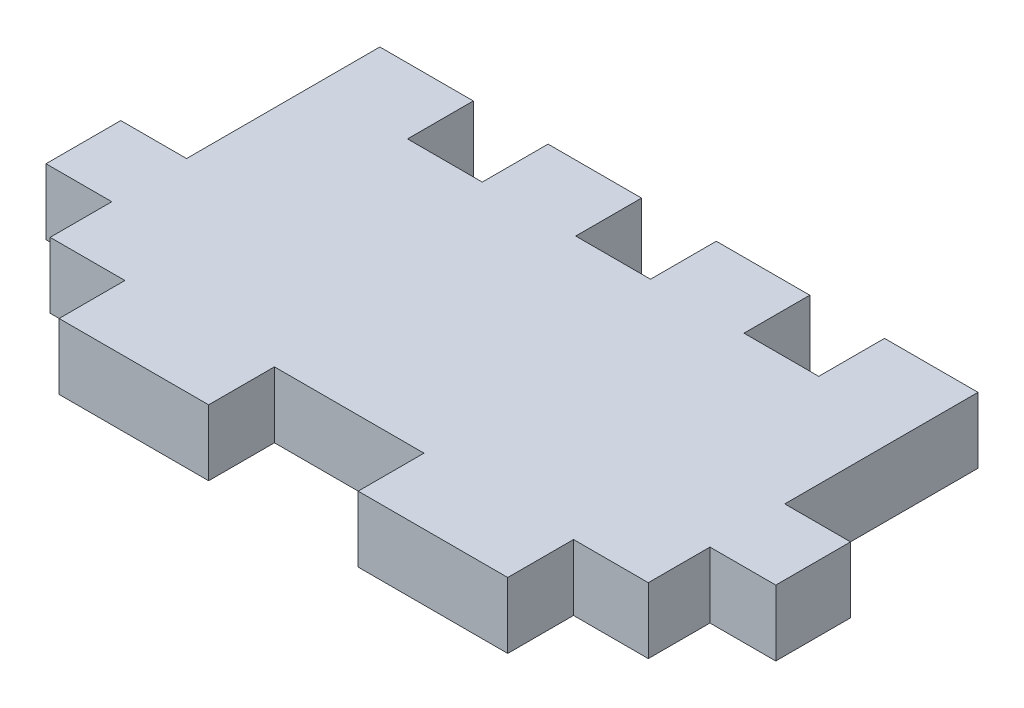
ISO-10303-21;
HEADER;
FILE_DESCRIPTION(('STEP AP214'),'2;1');
FILE_NAME('part.step','',(''),(''),'','','');
FILE_SCHEMA(('AUTOMOTIVE_DESIGN { 1 0 10303 214 1 1 1 1 }'));
ENDSEC;
DATA;
#1=APPLICATION_CONTEXT('core data for automotive mechanical design processes');
#2=APPLICATION_PROTOCOL_DEFINITION('international standard','automotive_design',2000,#1);
#3=PRODUCT_CONTEXT('',#1,'mechanical');
#4=PRODUCT('Part','Part','',(#3));
#5=PRODUCT_RELATED_PRODUCT_CATEGORY('part','',(#4));
#6=PRODUCT_DEFINITION_FORMATION('','',#4);
#7=PRODUCT_DEFINITION_CONTEXT('part definition',#1,'design');
#8=PRODUCT_DEFINITION('design','',#6,#7);
#9=PRODUCT_DEFINITION_SHAPE('','',#8);
#10=(LENGTH_UNIT() NAMED_UNIT(*) SI_UNIT(.MILLI.,.METRE.));
#11=(NAMED_UNIT(*) PLANE_ANGLE_UNIT() SI_UNIT($,.RADIAN.));
#12=(NAMED_UNIT(*) SI_UNIT($,.STERADIAN.) SOLID_ANGLE_UNIT());
#13=UNCERTAINTY_MEASURE_WITH_UNIT(LENGTH_MEASURE(1.E-05),#10,'distance_accuracy_value','');
#14=(GEOMETRIC_REPRESENTATION_CONTEXT(3) GLOBAL_UNCERTAINTY_ASSIGNED_CONTEXT((#13)) GLOBAL_UNIT_ASSIGNED_CONTEXT((#10,
#11,#12)) REPRESENTATION_CONTEXT('',''));
#15=CARTESIAN_POINT('',(0.,0.,0.));
#16=DIRECTION('',(0.,0.,1.));
#17=DIRECTION('',(1.,0.,0.));
#18=AXIS2_PLACEMENT_3D('',#15,#16,#17);
#19=CARTESIAN_POINT('',(0.,5.588,11.2059974));
#20=DIRECTION('',(0.,0.,1.));
#21=DIRECTION('',(1.,0.,0.));
#22=AXIS2_PLACEMENT_3D('',#19,#20,#21);
#23=PLANE('',#22);
#24=DIRECTION('',(-1.,0.,0.));
#25=VECTOR('',#24,1.);
#26=CARTESIAN_POINT('',(0.,0.,11.2059974));
#27=LINE('',#26,#25);
#28=CARTESIAN_POINT('',(25.4,0.,11.2059974));
#29=VERTEX_POINT('',#28);
#30=CARTESIAN_POINT('',(19.05,0.,11.2059974));
#31=VERTEX_POINT('',#30);
#32=EDGE_CURVE('E277',#29,#31,#27,.T.);
#33=ORIENTED_EDGE('',*,*,#32,.F.);
#34=DIRECTION('',(0.,-1.,0.));
#35=VECTOR('',#34,1.);
#36=CARTESIAN_POINT('',(25.4,5.588,11.2059974));
#37=LINE('',#36,#35);
#38=CARTESIAN_POINT('',(25.4,5.588,11.2059974));
#39=VERTEX_POINT('',#38);
#40=EDGE_CURVE('E11',#39,#29,#37,.T.);
#41=ORIENTED_EDGE('',*,*,#40,.F.);
#42=DIRECTION('',(-1.,0.,0.));
#43=VECTOR('',#42,1.);
#44=CARTESIAN_POINT('',(0.,5.588,11.2059974));
#45=LINE('',#44,#43);
#46=CARTESIAN_POINT('',(19.05,5.588,11.2059974));
#47=VERTEX_POINT('',#46);
#48=EDGE_CURVE('E355',#39,#47,#45,.T.);
#49=ORIENTED_EDGE('',*,*,#48,.T.);
#50=DIRECTION('',(0.,-1.,0.));
#51=VECTOR('',#50,1.);
#52=CARTESIAN_POINT('',(19.05,5.588,11.2059974));
#53=LINE('',#52,#51);
#54=EDGE_CURVE('E53',#47,#31,#53,.T.);
#55=ORIENTED_EDGE('',*,*,#54,.T.);
#56=EDGE_LOOP('',(#33,#41,#49,#55));
#57=FACE_BOUND('',#56,.T.);
#58=ADVANCED_FACE('F37',(#57),#23,.T.);
#59=CARTESIAN_POINT('',(25.4,5.588,0.));
#60=DIRECTION('',(-1.,0.,0.));
#61=DIRECTION('',(0.,0.,1.));
#62=AXIS2_PLACEMENT_3D('',#59,#60,#61);
#63=PLANE('',#62);
#64=DIRECTION('',(0.,0.,-1.));
#65=VECTOR('',#64,1.);
#66=CARTESIAN_POINT('',(25.4,0.,0.));
#67=LINE('',#66,#65);
#68=CARTESIAN_POINT('',(25.4,0.,5.9689974));
#69=VERTEX_POINT('',#68);
#70=EDGE_CURVE('E279',#29,#69,#67,.T.);
#71=ORIENTED_EDGE('',*,*,#70,.T.);
#72=DIRECTION('',(0.,-1.,0.));
#73=VECTOR('',#72,1.);
#74=CARTESIAN_POINT('',(25.4,5.588,5.9689974));
#75=LINE('',#74,#73);
#76=CARTESIAN_POINT('',(25.4,5.588,5.9689974));
#77=VERTEX_POINT('',#76);
#78=EDGE_CURVE('E45',#77,#69,#75,.T.);
#79=ORIENTED_EDGE('',*,*,#78,.F.);
#80=DIRECTION('',(0.,0.,-1.));
#81=VECTOR('',#80,1.);
#82=CARTESIAN_POINT('',(25.4,5.588,0.));
#83=LINE('',#82,#81);
#84=EDGE_CURVE('E438',#39,#77,#83,.T.);
#85=ORIENTED_EDGE('',*,*,#84,.F.);
#86=ORIENTED_EDGE('',*,*,#40,.T.);
#87=EDGE_LOOP('',(#71,#79,#85,#86));
#88=FACE_BOUND('',#87,.T.);
#89=ADVANCED_FACE('F426',(#88),#63,.F.);
#90=CARTESIAN_POINT('',(0.,5.588,5.9689974));
#91=DIRECTION('',(0.,0.,1.));
#92=DIRECTION('',(1.,0.,0.));
#93=AXIS2_PLACEMENT_3D('',#90,#91,#92);
#94=PLANE('',#93);
#95=DIRECTION('',(-1.,0.,0.));
#96=VECTOR('',#95,1.);
#97=CARTESIAN_POINT('',(0.,0.,5.9689974));
#98=LINE('',#97,#96);
#99=CARTESIAN_POINT('',(30.988,0.,5.9689974));
#100=VERTEX_POINT('',#99);
#101=EDGE_CURVE('E282',#100,#69,#98,.T.);
#102=ORIENTED_EDGE('',*,*,#101,.F.);
#103=DIRECTION('',(0.,-1.,0.));
#104=VECTOR('',#103,1.);
#105=CARTESIAN_POINT('',(30.988,5.588,5.9689974));
#106=LINE('',#105,#104);
#107=CARTESIAN_POINT('',(30.988,5.588,5.9689974));
#108=VERTEX_POINT('',#107);
#109=EDGE_CURVE('E416',#108,#100,#106,.T.);
#110=ORIENTED_EDGE('',*,*,#109,.F.);
#111=DIRECTION('',(-1.,0.,0.));
#112=VECTOR('',#111,1.);
#113=CARTESIAN_POINT('',(0.,5.588,5.9689974));
#114=LINE('',#113,#112);
#115=EDGE_CURVE('E423',#108,#77,#114,.T.);
#116=ORIENTED_EDGE('',*,*,#115,.T.);
#117=ORIENTED_EDGE('',*,*,#78,.T.);
#118=EDGE_LOOP('',(#102,#110,#116,#117));
#119=FACE_BOUND('',#118,.T.);
#120=ADVANCED_FACE('F421',(#119),#94,.T.);
#121=CARTESIAN_POINT('',(30.988,5.588,0.));
#122=DIRECTION('',(1.,0.,0.));
#123=DIRECTION('',(0.,0.,-1.));
#124=AXIS2_PLACEMENT_3D('',#121,#122,#123);
#125=PLANE('',#124);
#126=DIRECTION('',(0.,0.,1.));
#127=VECTOR('',#126,1.);
#128=CARTESIAN_POINT('',(30.988,0.,0.));
#129=LINE('',#128,#127);
#130=CARTESIAN_POINT('',(30.988,0.,-0.380997400000003));
#131=VERTEX_POINT('',#130);
#132=EDGE_CURVE('E285',#131,#100,#129,.T.);
#133=ORIENTED_EDGE('',*,*,#132,.F.);
#134=DIRECTION('',(0.,-1.,0.));
#135=VECTOR('',#134,1.);
#136=CARTESIAN_POINT('',(30.988,5.588,-0.380997400000003));
#137=LINE('',#136,#135);
#138=CARTESIAN_POINT('',(30.988,5.588,-0.380997400000003));
#139=VERTEX_POINT('',#138);
#140=EDGE_CURVE('E414',#139,#131,#137,.T.);
#141=ORIENTED_EDGE('',*,*,#140,.F.);
#142=DIRECTION('',(0.,0.,1.));
#143=VECTOR('',#142,1.);
#144=CARTESIAN_POINT('',(30.988,5.588,0.));
#145=LINE('',#144,#143);
#146=EDGE_CURVE('E435',#139,#108,#145,.T.);
#147=ORIENTED_EDGE('',*,*,#146,.T.);
#148=ORIENTED_EDGE('',*,*,#109,.T.);
#149=EDGE_LOOP('',(#133,#141,#147,#148));
#150=FACE_BOUND('',#149,.T.);
#151=ADVANCED_FACE('F432',(#150),#125,.T.);
#152=CARTESIAN_POINT('',(0.,5.588,-0.380997400000003));
#153=DIRECTION('',(0.,0.,-1.));
#154=DIRECTION('',(-1.,0.,0.));
#155=AXIS2_PLACEMENT_3D('',#152,#153,#154);
#156=PLANE('',#155);
#157=DIRECTION('',(1.,0.,0.));
#158=VECTOR('',#157,1.);
#159=CARTESIAN_POINT('',(0.,0.,-0.380997400000003));
#160=LINE('',#159,#158);
#161=CARTESIAN_POINT('',(25.4,0.,-0.380997400000003));
#162=VERTEX_POINT('',#161);
#163=EDGE_CURVE('E288',#162,#131,#160,.T.);
#164=ORIENTED_EDGE('',*,*,#163,.F.);
#165=DIRECTION('',(0.,-1.,0.));
#166=VECTOR('',#165,1.);
#167=CARTESIAN_POINT('',(25.4,5.588,-0.380997400000003));
#168=LINE('',#167,#166);
#169=CARTESIAN_POINT('',(25.4,5.588,-0.380997400000003));
#170=VERTEX_POINT('',#169);
#171=EDGE_CURVE('E412',#170,#162,#168,.T.);
#172=ORIENTED_EDGE('',*,*,#171,.F.);
#173=DIRECTION('',(1.,0.,0.));
#174=VECTOR('',#173,1.);
#175=CARTESIAN_POINT('',(0.,5.588,-0.380997400000003));
#176=LINE('',#175,#174);
#177=EDGE_CURVE('E440',#170,#139,#176,.T.);
#178=ORIENTED_EDGE('',*,*,#177,.T.);
#179=ORIENTED_EDGE('',*,*,#140,.T.);
#180=EDGE_LOOP('',(#164,#172,#178,#179));
#181=FACE_BOUND('',#180,.T.);
#182=ADVANCED_FACE('F525',(#181),#156,.T.);
#183=CARTESIAN_POINT('',(25.4,5.588,0.));
#184=DIRECTION('',(1.,0.,0.));
#185=DIRECTION('',(0.,0.,-1.));
#186=AXIS2_PLACEMENT_3D('',#183,#184,#185);
#187=PLANE('',#186);
#188=DIRECTION('',(0.,0.,1.));
#189=VECTOR('',#188,1.);
#190=CARTESIAN_POINT('',(25.4,0.,0.));
#191=LINE('',#190,#189);
#192=CARTESIAN_POINT('',(25.4,0.,-16.7939974));
#193=VERTEX_POINT('',#192);
#194=EDGE_CURVE('E291',#193,#162,#191,.T.);
#195=ORIENTED_EDGE('',*,*,#194,.F.);
#196=DIRECTION('',(0.,-1.,0.));
#197=VECTOR('',#196,1.);
#198=CARTESIAN_POINT('',(25.4,5.588,-16.7939974));
#199=LINE('',#198,#197);
#200=CARTESIAN_POINT('',(25.4,5.588,-16.7939974));
#201=VERTEX_POINT('',#200);
#202=EDGE_CURVE('E410',#201,#193,#199,.T.);
#203=ORIENTED_EDGE('',*,*,#202,.F.);
#204=DIRECTION('',(0.,0.,1.));
#205=VECTOR('',#204,1.);
#206=CARTESIAN_POINT('',(25.4,5.588,0.));
#207=LINE('',#206,#205);
#208=EDGE_CURVE('E446',#201,#170,#207,.T.);
#209=ORIENTED_EDGE('',*,*,#208,.T.);
#210=ORIENTED_EDGE('',*,*,#171,.T.);
#211=EDGE_LOOP('',(#195,#203,#209,#210));
#212=FACE_BOUND('',#211,.T.);
#213=ADVANCED_FACE('F528',(#212),#187,.T.);
#214=CARTESIAN_POINT('',(0.,5.588,-16.7939974));
#215=DIRECTION('',(0.,0.,-1.));
#216=DIRECTION('',(-1.,0.,0.));
#217=AXIS2_PLACEMENT_3D('',#214,#215,#216);
#218=PLANE('',#217);
#219=DIRECTION('',(1.,0.,0.));
#220=VECTOR('',#219,1.);
#221=CARTESIAN_POINT('',(0.,0.,-16.7939974));
#222=LINE('',#221,#220);
#223=CARTESIAN_POINT('',(17.4625,0.,-16.7939974));
#224=VERTEX_POINT('',#223);
#225=EDGE_CURVE('E294',#224,#193,#222,.T.);
#226=ORIENTED_EDGE('',*,*,#225,.F.);
#227=DIRECTION('',(0.,-1.,0.));
#228=VECTOR('',#227,1.);
#229=CARTESIAN_POINT('',(17.4625,5.588,-16.7939974));
#230=LINE('',#229,#228);
#231=CARTESIAN_POINT('',(17.4625,5.588,-16.7939974));
#232=VERTEX_POINT('',#231);
#233=EDGE_CURVE('E408',#232,#224,#230,.T.);
#234=ORIENTED_EDGE('',*,*,#233,.F.);
#235=DIRECTION('',(1.,0.,0.));
#236=VECTOR('',#235,1.);
#237=CARTESIAN_POINT('',(0.,5.588,-16.7939974));
#238=LINE('',#237,#236);
#239=EDGE_CURVE('E449',#232,#201,#238,.T.);
#240=ORIENTED_EDGE('',*,*,#239,.T.);
#241=ORIENTED_EDGE('',*,*,#202,.T.);
#242=EDGE_LOOP('',(#226,#234,#240,#241));
#243=FACE_BOUND('',#242,.T.);
#244=ADVANCED_FACE('F532',(#243),#218,.T.);
#245=CARTESIAN_POINT('',(17.4625,5.588,0.));
#246=DIRECTION('',(1.,0.,0.));
#247=DIRECTION('',(0.,0.,-1.));
#248=AXIS2_PLACEMENT_3D('',#245,#246,#247);
#249=PLANE('',#248);
#250=DIRECTION('',(0.,0.,1.));
#251=VECTOR('',#250,1.);
#252=CARTESIAN_POINT('',(17.4625,0.,0.));
#253=LINE('',#252,#251);
#254=CARTESIAN_POINT('',(17.4625,0.,-11.2059974));
#255=VERTEX_POINT('',#254);
#256=EDGE_CURVE('E297',#224,#255,#253,.T.);
#257=ORIENTED_EDGE('',*,*,#256,.T.);
#258=DIRECTION('',(0.,-1.,0.));
#259=VECTOR('',#258,1.);
#260=CARTESIAN_POINT('',(17.4625,5.588,-11.2059974));
#261=LINE('',#260,#259);
#262=CARTESIAN_POINT('',(17.4625,5.588,-11.2059974));
#263=VERTEX_POINT('',#262);
#264=EDGE_CURVE('E406',#263,#255,#261,.T.);
#265=ORIENTED_EDGE('',*,*,#264,.F.);
#266=DIRECTION('',(0.,0.,1.));
#267=VECTOR('',#266,1.);
#268=CARTESIAN_POINT('',(17.4625,5.588,0.));
#269=LINE('',#268,#267);
#270=EDGE_CURVE('E452',#232,#263,#269,.T.);
#271=ORIENTED_EDGE('',*,*,#270,.F.);
#272=ORIENTED_EDGE('',*,*,#233,.T.);
#273=EDGE_LOOP('',(#257,#265,#271,#272));
#274=FACE_BOUND('',#273,.T.);
#275=ADVANCED_FACE('F534',(#274),#249,.F.);
#276=CARTESIAN_POINT('',(0.,5.588,-11.2059974));
#277=DIRECTION('',(0.,0.,-1.));
#278=DIRECTION('',(-1.,0.,0.));
#279=AXIS2_PLACEMENT_3D('',#276,#277,#278);
#280=PLANE('',#279);
#281=DIRECTION('',(1.,0.,0.));
#282=VECTOR('',#281,1.);
#283=CARTESIAN_POINT('',(0.,0.,-11.2059974));
#284=LINE('',#283,#282);
#285=CARTESIAN_POINT('',(11.1125,0.,-11.2059974));
#286=VERTEX_POINT('',#285);
#287=EDGE_CURVE('E302',#286,#255,#284,.T.);
#288=ORIENTED_EDGE('',*,*,#287,.F.);
#289=DIRECTION('',(0.,-1.,0.));
#290=VECTOR('',#289,1.);
#291=CARTESIAN_POINT('',(11.1125,5.588,-11.2059974));
#292=LINE('',#291,#290);
#293=CARTESIAN_POINT('',(11.1125,5.588,-11.2059974));
#294=VERTEX_POINT('',#293);
#295=EDGE_CURVE('E404',#294,#286,#292,.T.);
#296=ORIENTED_EDGE('',*,*,#295,.F.);
#297=DIRECTION('',(1.,0.,0.));
#298=VECTOR('',#297,1.);
#299=CARTESIAN_POINT('',(0.,5.588,-11.2059974));
#300=LINE('',#299,#298);
#301=EDGE_CURVE('E456',#294,#263,#300,.T.);
#302=ORIENTED_EDGE('',*,*,#301,.T.);
#303=ORIENTED_EDGE('',*,*,#264,.T.);
#304=EDGE_LOOP('',(#288,#296,#302,#303));
#305=FACE_BOUND('',#304,.T.);
#306=ADVANCED_FACE('F537',(#305),#280,.T.);
#307=CARTESIAN_POINT('',(11.1125,5.588,0.));
#308=DIRECTION('',(1.,0.,0.));
#309=DIRECTION('',(0.,0.,-1.));
#310=AXIS2_PLACEMENT_3D('',#307,#308,#309);
#311=PLANE('',#310);
#312=DIRECTION('',(0.,0.,1.));
#313=VECTOR('',#312,1.);
#314=CARTESIAN_POINT('',(11.1125,0.,0.));
#315=LINE('',#314,#313);
#316=CARTESIAN_POINT('',(11.1125,0.,-16.7939974));
#317=VERTEX_POINT('',#316);
#318=EDGE_CURVE('E305',#317,#286,#315,.T.);
#319=ORIENTED_EDGE('',*,*,#318,.F.);
#320=DIRECTION('',(0.,-1.,0.));
#321=VECTOR('',#320,1.);
#322=CARTESIAN_POINT('',(11.1125,5.588,-16.7939974));
#323=LINE('',#322,#321);
#324=CARTESIAN_POINT('',(11.1125,5.588,-16.7939974));
#325=VERTEX_POINT('',#324);
#326=EDGE_CURVE('E402',#325,#317,#323,.T.);
#327=ORIENTED_EDGE('',*,*,#326,.F.);
#328=DIRECTION('',(0.,0.,1.));
#329=VECTOR('',#328,1.);
#330=CARTESIAN_POINT('',(11.1125,5.588,0.));
#331=LINE('',#330,#329);
#332=EDGE_CURVE('E459',#325,#294,#331,.T.);
#333=ORIENTED_EDGE('',*,*,#332,.T.);
#334=ORIENTED_EDGE('',*,*,#295,.T.);
#335=EDGE_LOOP('',(#319,#327,#333,#334));
#336=FACE_BOUND('',#335,.T.);
#337=ADVANCED_FACE('F541',(#336),#311,.T.);
#338=CARTESIAN_POINT('',(3.175,0.,-16.7939974));
#339=VERTEX_POINT('',#338);
#340=EDGE_CURVE('E299',#339,#317,#222,.T.);
#341=ORIENTED_EDGE('',*,*,#340,.F.);
#342=DIRECTION('',(0.,-1.,0.));
#343=VECTOR('',#342,1.);
#344=CARTESIAN_POINT('',(3.175,5.588,-16.7939974));
#345=LINE('',#344,#343);
#346=CARTESIAN_POINT('',(3.175,5.588,-16.7939974));
#347=VERTEX_POINT('',#346);
#348=EDGE_CURVE('E400',#347,#339,#345,.T.);
#349=ORIENTED_EDGE('',*,*,#348,.F.);
#350=EDGE_CURVE('E454',#347,#325,#238,.T.);
#351=ORIENTED_EDGE('',*,*,#350,.T.);
#352=ORIENTED_EDGE('',*,*,#326,.T.);
#353=EDGE_LOOP('',(#341,#349,#351,#352));
#354=FACE_BOUND('',#353,.T.);
#355=ADVANCED_FACE('F545',(#354),#218,.T.);
#356=CARTESIAN_POINT('',(3.175,5.588,0.));
#357=DIRECTION('',(1.,0.,0.));
#358=DIRECTION('',(0.,0.,-1.));
#359=AXIS2_PLACEMENT_3D('',#356,#357,#358);
#360=PLANE('',#359);
#361=DIRECTION('',(0.,0.,1.));
#362=VECTOR('',#361,1.);
#363=CARTESIAN_POINT('',(3.175,0.,0.));
#364=LINE('',#363,#362);
#365=CARTESIAN_POINT('',(3.175,0.,-11.2059974));
#366=VERTEX_POINT('',#365);
#367=EDGE_CURVE('E308',#339,#366,#364,.T.);
#368=ORIENTED_EDGE('',*,*,#367,.T.);
#369=DIRECTION('',(0.,-1.,0.));
#370=VECTOR('',#369,1.);
#371=CARTESIAN_POINT('',(3.175,5.588,-11.2059974));
#372=LINE('',#371,#370);
#373=CARTESIAN_POINT('',(3.175,5.588,-11.2059974));
#374=VERTEX_POINT('',#373);
#375=EDGE_CURVE('E398',#374,#366,#372,.T.);
#376=ORIENTED_EDGE('',*,*,#375,.F.);
#377=DIRECTION('',(0.,0.,1.));
#378=VECTOR('',#377,1.);
#379=CARTESIAN_POINT('',(3.175,5.588,0.));
#380=LINE('',#379,#378);
#381=EDGE_CURVE('E462',#347,#374,#380,.T.);
#382=ORIENTED_EDGE('',*,*,#381,.F.);
#383=ORIENTED_EDGE('',*,*,#348,.T.);
#384=EDGE_LOOP('',(#368,#376,#382,#383));
#385=FACE_BOUND('',#384,.T.);
#386=ADVANCED_FACE('F547',(#385),#360,.F.);
#387=CARTESIAN_POINT('',(0.,5.588,-11.2059974));
#388=DIRECTION('',(0.,0.,-1.));
#389=DIRECTION('',(-1.,0.,0.));
#390=AXIS2_PLACEMENT_3D('',#387,#388,#389);
#391=PLANE('',#390);
#392=DIRECTION('',(1.,0.,0.));
#393=VECTOR('',#392,1.);
#394=CARTESIAN_POINT('',(0.,0.,-11.2059974));
#395=LINE('',#394,#393);
#396=CARTESIAN_POINT('',(-3.175,0.,-11.2059974));
#397=VERTEX_POINT('',#396);
#398=EDGE_CURVE('E311',#397,#366,#395,.T.);
#399=ORIENTED_EDGE('',*,*,#398,.F.);
#400=DIRECTION('',(0.,-1.,0.));
#401=VECTOR('',#400,1.);
#402=CARTESIAN_POINT('',(-3.175,5.588,-11.2059974));
#403=LINE('',#402,#401);
#404=CARTESIAN_POINT('',(-3.175,5.588,-11.2059974));
#405=VERTEX_POINT('',#404);
#406=EDGE_CURVE('E396',#405,#397,#403,.T.);
#407=ORIENTED_EDGE('',*,*,#406,.F.);
#408=DIRECTION('',(1.,0.,0.));
#409=VECTOR('',#408,1.);
#410=CARTESIAN_POINT('',(0.,5.588,-11.2059974));
#411=LINE('',#410,#409);
#412=EDGE_CURVE('E464',#405,#374,#411,.T.);
#413=ORIENTED_EDGE('',*,*,#412,.T.);
#414=ORIENTED_EDGE('',*,*,#375,.T.);
#415=EDGE_LOOP('',(#399,#407,#413,#414));
#416=FACE_BOUND('',#415,.T.);
#417=ADVANCED_FACE('F550',(#416),#391,.T.);
#418=CARTESIAN_POINT('',(-3.175,5.588,0.));
#419=DIRECTION('',(1.,0.,0.));
#420=DIRECTION('',(0.,0.,-1.));
#421=AXIS2_PLACEMENT_3D('',#418,#419,#420);
#422=PLANE('',#421);
#423=DIRECTION('',(0.,0.,1.));
#424=VECTOR('',#423,1.);
#425=CARTESIAN_POINT('',(-3.175,0.,0.));
#426=LINE('',#425,#424);
#427=CARTESIAN_POINT('',(-3.175,0.,-16.7939974));
#428=VERTEX_POINT('',#427);
#429=EDGE_CURVE('E314',#428,#397,#426,.T.);
#430=ORIENTED_EDGE('',*,*,#429,.F.);
#431=DIRECTION('',(0.,-1.,0.));
#432=VECTOR('',#431,1.);
#433=CARTESIAN_POINT('',(-3.175,5.588,-16.7939974));
#434=LINE('',#433,#432);
#435=CARTESIAN_POINT('',(-3.175,5.588,-16.7939974));
#436=VERTEX_POINT('',#435);
#437=EDGE_CURVE('E394',#436,#428,#434,.T.);
#438=ORIENTED_EDGE('',*,*,#437,.F.);
#439=DIRECTION('',(0.,0.,1.));
#440=VECTOR('',#439,1.);
#441=CARTESIAN_POINT('',(-3.175,5.588,0.));
#442=LINE('',#441,#440);
#443=EDGE_CURVE('E467',#436,#405,#442,.T.);
#444=ORIENTED_EDGE('',*,*,#443,.T.);
#445=ORIENTED_EDGE('',*,*,#406,.T.);
#446=EDGE_LOOP('',(#430,#438,#444,#445));
#447=FACE_BOUND('',#446,.T.);
#448=ADVANCED_FACE('F554',(#447),#422,.T.);
#449=CARTESIAN_POINT('',(-11.1125,0.,-16.7939974));
#450=VERTEX_POINT('',#449);
#451=EDGE_CURVE('E317',#450,#428,#222,.T.);
#452=ORIENTED_EDGE('',*,*,#451,.F.);
#453=DIRECTION('',(0.,-1.,0.));
#454=VECTOR('',#453,1.);
#455=CARTESIAN_POINT('',(-11.1125,5.588,-16.7939974));
#456=LINE('',#455,#454);
#457=CARTESIAN_POINT('',(-11.1125,5.588,-16.7939974));
#458=VERTEX_POINT('',#457);
#459=EDGE_CURVE('E392',#458,#450,#456,.T.);
#460=ORIENTED_EDGE('',*,*,#459,.F.);
#461=EDGE_CURVE('E470',#458,#436,#238,.T.);
#462=ORIENTED_EDGE('',*,*,#461,.T.);
#463=ORIENTED_EDGE('',*,*,#437,.T.);
#464=EDGE_LOOP('',(#452,#460,#462,#463));
#465=FACE_BOUND('',#464,.T.);
#466=ADVANCED_FACE('F558',(#465),#218,.T.);
#467=CARTESIAN_POINT('',(-11.1125,5.588,0.));
#468=DIRECTION('',(1.,0.,0.));
#469=DIRECTION('',(0.,0.,-1.));
#470=AXIS2_PLACEMENT_3D('',#467,#468,#469);
#471=PLANE('',#470);
#472=DIRECTION('',(0.,0.,1.));
#473=VECTOR('',#472,1.);
#474=CARTESIAN_POINT('',(-11.1125,0.,0.));
#475=LINE('',#474,#473);
#476=CARTESIAN_POINT('',(-11.1125,0.,-11.2059974));
#477=VERTEX_POINT('',#476);
#478=EDGE_CURVE('E318',#450,#477,#475,.T.);
#479=ORIENTED_EDGE('',*,*,#478,.T.);
#480=DIRECTION('',(0.,-1.,0.));
#481=VECTOR('',#480,1.);
#482=CARTESIAN_POINT('',(-11.1125,5.588,-11.2059974));
#483=LINE('',#482,#481);
#484=CARTESIAN_POINT('',(-11.1125,5.588,-11.2059974));
#485=VERTEX_POINT('',#484);
#486=EDGE_CURVE('E390',#485,#477,#483,.T.);
#487=ORIENTED_EDGE('',*,*,#486,.F.);
#488=DIRECTION('',(0.,0.,1.));
#489=VECTOR('',#488,1.);
#490=CARTESIAN_POINT('',(-11.1125,5.588,0.));
#491=LINE('',#490,#489);
#492=EDGE_CURVE('E471',#458,#485,#491,.T.);
#493=ORIENTED_EDGE('',*,*,#492,.F.);
#494=ORIENTED_EDGE('',*,*,#459,.T.);
#495=EDGE_LOOP('',(#479,#487,#493,#494));
#496=FACE_BOUND('',#495,.T.);
#497=ADVANCED_FACE('F560',(#496),#471,.F.);
#498=CARTESIAN_POINT('',(0.,5.588,-11.2059974));
#499=DIRECTION('',(0.,0.,-1.));
#500=DIRECTION('',(-1.,0.,0.));
#501=AXIS2_PLACEMENT_3D('',#498,#499,#500);
#502=PLANE('',#501);
#503=DIRECTION('',(1.,0.,0.));
#504=VECTOR('',#503,1.);
#505=CARTESIAN_POINT('',(0.,0.,-11.2059974));
#506=LINE('',#505,#504);
#507=CARTESIAN_POINT('',(-17.4625,0.,-11.2059974));
#508=VERTEX_POINT('',#507);
#509=EDGE_CURVE('E321',#508,#477,#506,.T.);
#510=ORIENTED_EDGE('',*,*,#509,.F.);
#511=DIRECTION('',(0.,-1.,0.));
#512=VECTOR('',#511,1.);
#513=CARTESIAN_POINT('',(-17.4625,5.588,-11.2059974));
#514=LINE('',#513,#512);
#515=CARTESIAN_POINT('',(-17.4625,5.588,-11.2059974));
#516=VERTEX_POINT('',#515);
#517=EDGE_CURVE('E388',#516,#508,#514,.T.);
#518=ORIENTED_EDGE('',*,*,#517,.F.);
#519=DIRECTION('',(1.,0.,0.));
#520=VECTOR('',#519,1.);
#521=CARTESIAN_POINT('',(0.,5.588,-11.2059974));
#522=LINE('',#521,#520);
#523=EDGE_CURVE('E473',#516,#485,#522,.T.);
#524=ORIENTED_EDGE('',*,*,#523,.T.);
#525=ORIENTED_EDGE('',*,*,#486,.T.);
#526=EDGE_LOOP('',(#510,#518,#524,#525));
#527=FACE_BOUND('',#526,.T.);
#528=ADVANCED_FACE('F563',(#527),#502,.T.);
#529=CARTESIAN_POINT('',(-17.4625,5.588,0.));
#530=DIRECTION('',(1.,0.,0.));
#531=DIRECTION('',(0.,0.,-1.));
#532=AXIS2_PLACEMENT_3D('',#529,#530,#531);
#533=PLANE('',#532);
#534=DIRECTION('',(0.,0.,1.));
#535=VECTOR('',#534,1.);
#536=CARTESIAN_POINT('',(-17.4625,0.,0.));
#537=LINE('',#536,#535);
#538=CARTESIAN_POINT('',(-17.4625,0.,-16.7939974));
#539=VERTEX_POINT('',#538);
#540=EDGE_CURVE('E324',#539,#508,#537,.T.);
#541=ORIENTED_EDGE('',*,*,#540,.F.);
#542=DIRECTION('',(0.,-1.,0.));
#543=VECTOR('',#542,1.);
#544=CARTESIAN_POINT('',(-17.4625,5.588,-16.7939974));
#545=LINE('',#544,#543);
#546=CARTESIAN_POINT('',(-17.4625,5.588,-16.7939974));
#547=VERTEX_POINT('',#546);
#548=EDGE_CURVE('E386',#547,#539,#545,.T.);
#549=ORIENTED_EDGE('',*,*,#548,.F.);
#550=DIRECTION('',(0.,0.,1.));
#551=VECTOR('',#550,1.);
#552=CARTESIAN_POINT('',(-17.4625,5.588,0.));
#553=LINE('',#552,#551);
#554=EDGE_CURVE('E476',#547,#516,#553,.T.);
#555=ORIENTED_EDGE('',*,*,#554,.T.);
#556=ORIENTED_EDGE('',*,*,#517,.T.);
#557=EDGE_LOOP('',(#541,#549,#555,#556));
#558=FACE_BOUND('',#557,.T.);
#559=ADVANCED_FACE('F567',(#558),#533,.T.);
#560=CARTESIAN_POINT('',(-25.4,0.,-16.7939974));
#561=VERTEX_POINT('',#560);
#562=EDGE_CURVE('E298',#561,#539,#222,.T.);
#563=ORIENTED_EDGE('',*,*,#562,.F.);
#564=DIRECTION('',(0.,-1.,0.));
#565=VECTOR('',#564,1.);
#566=CARTESIAN_POINT('',(-25.4,5.588,-16.7939974));
#567=LINE('',#566,#565);
#568=CARTESIAN_POINT('',(-25.4,5.588,-16.7939974));
#569=VERTEX_POINT('',#568);
#570=EDGE_CURVE('E384',#569,#561,#567,.T.);
#571=ORIENTED_EDGE('',*,*,#570,.F.);
#572=EDGE_CURVE('E453',#569,#547,#238,.T.);
#573=ORIENTED_EDGE('',*,*,#572,.T.);
#574=ORIENTED_EDGE('',*,*,#548,.T.);
#575=EDGE_LOOP('',(#563,#571,#573,#574));
#576=FACE_BOUND('',#575,.T.);
#577=ADVANCED_FACE('F571',(#576),#218,.T.);
#578=CARTESIAN_POINT('',(-25.4,5.588,0.));
#579=DIRECTION('',(1.,0.,0.));
#580=DIRECTION('',(0.,0.,-1.));
#581=AXIS2_PLACEMENT_3D('',#578,#579,#580);
#582=PLANE('',#581);
#583=DIRECTION('',(0.,0.,1.));
#584=VECTOR('',#583,1.);
#585=CARTESIAN_POINT('',(-25.4,0.,0.));
#586=LINE('',#585,#584);
#587=CARTESIAN_POINT('',(-25.4,0.,-0.380997400000003));
#588=VERTEX_POINT('',#587);
#589=EDGE_CURVE('E327',#561,#588,#586,.T.);
#590=ORIENTED_EDGE('',*,*,#589,.T.);
#591=DIRECTION('',(0.,-1.,0.));
#592=VECTOR('',#591,1.);
#593=CARTESIAN_POINT('',(-25.4,5.588,-0.380997400000003));
#594=LINE('',#593,#592);
#595=CARTESIAN_POINT('',(-25.4,5.588,-0.380997400000003));
#596=VERTEX_POINT('',#595);
#597=EDGE_CURVE('E381',#596,#588,#594,.T.);
#598=ORIENTED_EDGE('',*,*,#597,.F.);
#599=DIRECTION('',(0.,0.,1.));
#600=VECTOR('',#599,1.);
#601=CARTESIAN_POINT('',(-25.4,5.588,0.));
#602=LINE('',#601,#600);
#603=EDGE_CURVE('E479',#569,#596,#602,.T.);
#604=ORIENTED_EDGE('',*,*,#603,.F.);
#605=ORIENTED_EDGE('',*,*,#570,.T.);
#606=EDGE_LOOP('',(#590,#598,#604,#605));
#607=FACE_BOUND('',#606,.T.);
#608=ADVANCED_FACE('F575',(#607),#582,.F.);
#609=CARTESIAN_POINT('',(0.,5.588,-0.380997399999999));
#610=DIRECTION('',(0.,0.,1.));
#611=DIRECTION('',(1.,0.,0.));
#612=AXIS2_PLACEMENT_3D('',#609,#610,#611);
#613=PLANE('',#612);
#614=DIRECTION('',(-1.,0.,0.));
#615=VECTOR('',#614,1.);
#616=CARTESIAN_POINT('',(0.,0.,-0.380997399999999));
#617=LINE('',#616,#615);
#618=CARTESIAN_POINT('',(-30.988,0.,-0.380997400000003));
#619=VERTEX_POINT('',#618);
#620=EDGE_CURVE('E329',#588,#619,#617,.T.);
#621=ORIENTED_EDGE('',*,*,#620,.T.);
#622=DIRECTION('',(0.,-1.,0.));
#623=VECTOR('',#622,1.);
#624=CARTESIAN_POINT('',(-30.988,5.588,-0.380997400000003));
#625=LINE('',#624,#623);
#626=CARTESIAN_POINT('',(-30.988,5.588,-0.380997400000003));
#627=VERTEX_POINT('',#626);
#628=EDGE_CURVE('E378',#627,#619,#625,.T.);
#629=ORIENTED_EDGE('',*,*,#628,.F.);
#630=DIRECTION('',(-1.,0.,0.));
#631=VECTOR('',#630,1.);
#632=CARTESIAN_POINT('',(0.,5.588,-0.380997399999999));
#633=LINE('',#632,#631);
#634=EDGE_CURVE('E481',#596,#627,#633,.T.);
#635=ORIENTED_EDGE('',*,*,#634,.F.);
#636=ORIENTED_EDGE('',*,*,#597,.T.);
#637=EDGE_LOOP('',(#621,#629,#635,#636));
#638=FACE_BOUND('',#637,.T.);
#639=ADVANCED_FACE('F579',(#638),#613,.F.);
#640=CARTESIAN_POINT('',(-30.988,5.588,0.));
#641=DIRECTION('',(1.,0.,0.));
#642=DIRECTION('',(0.,0.,-1.));
#643=AXIS2_PLACEMENT_3D('',#640,#641,#642);
#644=PLANE('',#643);
#645=DIRECTION('',(0.,0.,1.));
#646=VECTOR('',#645,1.);
#647=CARTESIAN_POINT('',(-30.988,0.,0.));
#648=LINE('',#647,#646);
#649=CARTESIAN_POINT('',(-30.988,0.,5.9689974));
#650=VERTEX_POINT('',#649);
#651=EDGE_CURVE('E331',#619,#650,#648,.T.);
#652=ORIENTED_EDGE('',*,*,#651,.T.);
#653=DIRECTION('',(0.,-1.,0.));
#654=VECTOR('',#653,1.);
#655=CARTESIAN_POINT('',(-30.988,5.588,5.9689974));
#656=LINE('',#655,#654);
#657=CARTESIAN_POINT('',(-30.988,5.588,5.9689974));
#658=VERTEX_POINT('',#657);
#659=EDGE_CURVE('E375',#658,#650,#656,.T.);
#660=ORIENTED_EDGE('',*,*,#659,.F.);
#661=DIRECTION('',(0.,0.,1.));
#662=VECTOR('',#661,1.);
#663=CARTESIAN_POINT('',(-30.988,5.588,0.));
#664=LINE('',#663,#662);
#665=EDGE_CURVE('E483',#627,#658,#664,.T.);
#666=ORIENTED_EDGE('',*,*,#665,.F.);
#667=ORIENTED_EDGE('',*,*,#628,.T.);
#668=EDGE_LOOP('',(#652,#660,#666,#667));
#669=FACE_BOUND('',#668,.T.);
#670=ADVANCED_FACE('F583',(#669),#644,.F.);
#671=CARTESIAN_POINT('',(0.,5.588,5.9689974));
#672=DIRECTION('',(0.,0.,-1.));
#673=DIRECTION('',(-1.,0.,0.));
#674=AXIS2_PLACEMENT_3D('',#671,#672,#673);
#675=PLANE('',#674);
#676=DIRECTION('',(1.,0.,0.));
#677=VECTOR('',#676,1.);
#678=CARTESIAN_POINT('',(0.,0.,5.9689974));
#679=LINE('',#678,#677);
#680=CARTESIAN_POINT('',(-25.4,0.,5.9689974));
#681=VERTEX_POINT('',#680);
#682=EDGE_CURVE('E333',#650,#681,#679,.T.);
#683=ORIENTED_EDGE('',*,*,#682,.T.);
#684=DIRECTION('',(0.,-1.,0.));
#685=VECTOR('',#684,1.);
#686=CARTESIAN_POINT('',(-25.4,5.588,5.9689974));
#687=LINE('',#686,#685);
#688=CARTESIAN_POINT('',(-25.4,5.588,5.9689974));
#689=VERTEX_POINT('',#688);
#690=EDGE_CURVE('E373',#689,#681,#687,.T.);
#691=ORIENTED_EDGE('',*,*,#690,.F.);
#692=DIRECTION('',(1.,0.,0.));
#693=VECTOR('',#692,1.);
#694=CARTESIAN_POINT('',(0.,5.588,5.9689974));
#695=LINE('',#694,#693);
#696=EDGE_CURVE('E485',#658,#689,#695,.T.);
#697=ORIENTED_EDGE('',*,*,#696,.F.);
#698=ORIENTED_EDGE('',*,*,#659,.T.);
#699=EDGE_LOOP('',(#683,#691,#697,#698));
#700=FACE_BOUND('',#699,.T.);
#701=ADVANCED_FACE('F587',(#700),#675,.F.);
#702=CARTESIAN_POINT('',(-25.4,5.588,0.));
#703=DIRECTION('',(-1.,0.,0.));
#704=DIRECTION('',(0.,0.,1.));
#705=AXIS2_PLACEMENT_3D('',#702,#703,#704);
#706=PLANE('',#705);
#707=DIRECTION('',(0.,0.,-1.));
#708=VECTOR('',#707,1.);
#709=CARTESIAN_POINT('',(-25.4,0.,0.));
#710=LINE('',#709,#708);
#711=CARTESIAN_POINT('',(-25.4,0.,11.2059974));
#712=VERTEX_POINT('',#711);
#713=EDGE_CURVE('E336',#712,#681,#710,.T.);
#714=ORIENTED_EDGE('',*,*,#713,.F.);
#715=DIRECTION('',(0.,-1.,0.));
#716=VECTOR('',#715,1.);
#717=CARTESIAN_POINT('',(-25.4,5.588,11.2059974));
#718=LINE('',#717,#716);
#719=CARTESIAN_POINT('',(-25.4,5.588,11.2059974));
#720=VERTEX_POINT('',#719);
#721=EDGE_CURVE('E371',#720,#712,#718,.T.);
#722=ORIENTED_EDGE('',*,*,#721,.F.);
#723=DIRECTION('',(0.,0.,-1.));
#724=VECTOR('',#723,1.);
#725=CARTESIAN_POINT('',(-25.4,5.588,0.));
#726=LINE('',#725,#724);
#727=EDGE_CURVE('E487',#720,#689,#726,.T.);
#728=ORIENTED_EDGE('',*,*,#727,.T.);
#729=ORIENTED_EDGE('',*,*,#690,.T.);
#730=EDGE_LOOP('',(#714,#722,#728,#729));
#731=FACE_BOUND('',#730,.T.);
#732=ADVANCED_FACE('F591',(#731),#706,.T.);
#733=CARTESIAN_POINT('',(0.,5.588,11.2059974));
#734=DIRECTION('',(0.,0.,-1.));
#735=DIRECTION('',(-1.,0.,0.));
#736=AXIS2_PLACEMENT_3D('',#733,#734,#735);
#737=PLANE('',#736);
#738=DIRECTION('',(1.,0.,0.));
#739=VECTOR('',#738,1.);
#740=CARTESIAN_POINT('',(0.,0.,11.2059974));
#741=LINE('',#740,#739);
#742=CARTESIAN_POINT('',(-19.05,0.,11.2059974));
#743=VERTEX_POINT('',#742);
#744=EDGE_CURVE('E339',#712,#743,#741,.T.);
#745=ORIENTED_EDGE('',*,*,#744,.T.);
#746=DIRECTION('',(0.,-1.,0.));
#747=VECTOR('',#746,1.);
#748=CARTESIAN_POINT('',(-19.05,5.588,11.2059974));
#749=LINE('',#748,#747);
#750=CARTESIAN_POINT('',(-19.05,5.588,11.2059974));
#751=VERTEX_POINT('',#750);
#752=EDGE_CURVE('E368',#751,#743,#749,.T.);
#753=ORIENTED_EDGE('',*,*,#752,.F.);
#754=DIRECTION('',(1.,0.,0.));
#755=VECTOR('',#754,1.);
#756=CARTESIAN_POINT('',(0.,5.588,11.2059974));
#757=LINE('',#756,#755);
#758=EDGE_CURVE('E490',#720,#751,#757,.T.);
#759=ORIENTED_EDGE('',*,*,#758,.F.);
#760=ORIENTED_EDGE('',*,*,#721,.T.);
#761=EDGE_LOOP('',(#745,#753,#759,#760));
#762=FACE_BOUND('',#761,.T.);
#763=ADVANCED_FACE('F595',(#762),#737,.F.);
#764=CARTESIAN_POINT('',(-19.05,5.588,0.));
#765=DIRECTION('',(1.,0.,0.));
#766=DIRECTION('',(0.,0.,-1.));
#767=AXIS2_PLACEMENT_3D('',#764,#765,#766);
#768=PLANE('',#767);
#769=DIRECTION('',(0.,0.,1.));
#770=VECTOR('',#769,1.);
#771=CARTESIAN_POINT('',(-19.05,0.,0.));
#772=LINE('',#771,#770);
#773=CARTESIAN_POINT('',(-19.05,0.,16.7939974));
#774=VERTEX_POINT('',#773);
#775=EDGE_CURVE('E341',#743,#774,#772,.T.);
#776=ORIENTED_EDGE('',*,*,#775,.T.);
#777=DIRECTION('',(0.,-1.,0.));
#778=VECTOR('',#777,1.);
#779=CARTESIAN_POINT('',(-19.05,5.588,16.7939974));
#780=LINE('',#779,#778);
#781=CARTESIAN_POINT('',(-19.05,5.588,16.7939974));
#782=VERTEX_POINT('',#781);
#783=EDGE_CURVE('E365',#782,#774,#780,.T.);
#784=ORIENTED_EDGE('',*,*,#783,.F.);
#785=DIRECTION('',(0.,0.,1.));
#786=VECTOR('',#785,1.);
#787=CARTESIAN_POINT('',(-19.05,5.588,0.));
#788=LINE('',#787,#786);
#789=EDGE_CURVE('E492',#751,#782,#788,.T.);
#790=ORIENTED_EDGE('',*,*,#789,.F.);
#791=ORIENTED_EDGE('',*,*,#752,.T.);
#792=EDGE_LOOP('',(#776,#784,#790,#791));
#793=FACE_BOUND('',#792,.T.);
#794=ADVANCED_FACE('F599',(#793),#768,.F.);
#795=CARTESIAN_POINT('',(0.,5.588,16.7939974));
#796=DIRECTION('',(0.,0.,-1.));
#797=DIRECTION('',(-1.,0.,0.));
#798=AXIS2_PLACEMENT_3D('',#795,#796,#797);
#799=PLANE('',#798);
#800=DIRECTION('',(1.,0.,0.));
#801=VECTOR('',#800,1.);
#802=CARTESIAN_POINT('',(0.,0.,16.7939974));
#803=LINE('',#802,#801);
#804=CARTESIAN_POINT('',(-6.35,0.,16.7939974));
#805=VERTEX_POINT('',#804);
#806=EDGE_CURVE('E343',#774,#805,#803,.T.);
#807=ORIENTED_EDGE('',*,*,#806,.T.);
#808=DIRECTION('',(0.,-1.,0.));
#809=VECTOR('',#808,1.);
#810=CARTESIAN_POINT('',(-6.35,5.588,16.7939974));
#811=LINE('',#810,#809);
#812=CARTESIAN_POINT('',(-6.35,5.588,16.7939974));
#813=VERTEX_POINT('',#812);
#814=EDGE_CURVE('E362',#813,#805,#811,.T.);
#815=ORIENTED_EDGE('',*,*,#814,.F.);
#816=DIRECTION('',(1.,0.,0.));
#817=VECTOR('',#816,1.);
#818=CARTESIAN_POINT('',(0.,5.588,16.7939974));
#819=LINE('',#818,#817);
#820=EDGE_CURVE('E265',#782,#813,#819,.T.);
#821=ORIENTED_EDGE('',*,*,#820,.F.);
#822=ORIENTED_EDGE('',*,*,#783,.T.);
#823=EDGE_LOOP('',(#807,#815,#821,#822));
#824=FACE_BOUND('',#823,.T.);
#825=ADVANCED_FACE('F512',(#824),#799,.F.);
#826=CARTESIAN_POINT('',(-6.35,5.588,0.));
#827=DIRECTION('',(-1.,0.,0.));
#828=DIRECTION('',(0.,0.,1.));
#829=AXIS2_PLACEMENT_3D('',#826,#827,#828);
#830=PLANE('',#829);
#831=DIRECTION('',(0.,0.,-1.));
#832=VECTOR('',#831,1.);
#833=CARTESIAN_POINT('',(-6.35,0.,0.));
#834=LINE('',#833,#832);
#835=CARTESIAN_POINT('',(-6.35,0.,11.2059974));
#836=VERTEX_POINT('',#835);
#837=EDGE_CURVE('E345',#805,#836,#834,.T.);
#838=ORIENTED_EDGE('',*,*,#837,.T.);
#839=DIRECTION('',(0.,-1.,0.));
#840=VECTOR('',#839,1.);
#841=CARTESIAN_POINT('',(-6.35,5.588,11.2059974));
#842=LINE('',#841,#840);
#843=CARTESIAN_POINT('',(-6.35,5.588,11.2059974));
#844=VERTEX_POINT('',#843);
#845=EDGE_CURVE('E359',#844,#836,#842,.T.);
#846=ORIENTED_EDGE('',*,*,#845,.F.);
#847=DIRECTION('',(0.,0.,-1.));
#848=VECTOR('',#847,1.);
#849=CARTESIAN_POINT('',(-6.35,5.588,0.));
#850=LINE('',#849,#848);
#851=EDGE_CURVE('E272',#813,#844,#850,.T.);
#852=ORIENTED_EDGE('',*,*,#851,.F.);
#853=ORIENTED_EDGE('',*,*,#814,.T.);
#854=EDGE_LOOP('',(#838,#846,#852,#853));
#855=FACE_BOUND('',#854,.T.);
#856=ADVANCED_FACE('F498',(#855),#830,.F.);
#857=CARTESIAN_POINT('',(0.,5.588,11.2059974));
#858=DIRECTION('',(0.,0.,-1.));
#859=DIRECTION('',(-1.,0.,0.));
#860=AXIS2_PLACEMENT_3D('',#857,#858,#859);
#861=PLANE('',#860);
#862=DIRECTION('',(1.,0.,0.));
#863=VECTOR('',#862,1.);
#864=CARTESIAN_POINT('',(0.,0.,11.2059974));
#865=LINE('',#864,#863);
#866=CARTESIAN_POINT('',(6.35,0.,11.2059974));
#867=VERTEX_POINT('',#866);
#868=EDGE_CURVE('E348',#836,#867,#865,.T.);
#869=ORIENTED_EDGE('',*,*,#868,.T.);
#870=DIRECTION('',(0.,-1.,0.));
#871=VECTOR('',#870,1.);
#872=CARTESIAN_POINT('',(6.35,5.588,11.2059974));
#873=LINE('',#872,#871);
#874=CARTESIAN_POINT('',(6.35,5.588,11.2059974));
#875=VERTEX_POINT('',#874);
#876=EDGE_CURVE('E257',#875,#867,#873,.T.);
#877=ORIENTED_EDGE('',*,*,#876,.F.);
#878=DIRECTION('',(1.,0.,0.));
#879=VECTOR('',#878,1.);
#880=CARTESIAN_POINT('',(0.,5.588,11.2059974));
#881=LINE('',#880,#879);
#882=EDGE_CURVE('E269',#844,#875,#881,.T.);
#883=ORIENTED_EDGE('',*,*,#882,.F.);
#884=ORIENTED_EDGE('',*,*,#845,.T.);
#885=EDGE_LOOP('',(#869,#877,#883,#884));
#886=FACE_BOUND('',#885,.T.);
#887=ADVANCED_FACE('F502',(#886),#861,.F.);
#888=CARTESIAN_POINT('',(6.35,5.588,0.));
#889=DIRECTION('',(-1.,0.,0.));
#890=DIRECTION('',(0.,0.,1.));
#891=AXIS2_PLACEMENT_3D('',#888,#889,#890);
#892=PLANE('',#891);
#893=DIRECTION('',(0.,0.,-1.));
#894=VECTOR('',#893,1.);
#895=CARTESIAN_POINT('',(6.35,0.,0.));
#896=LINE('',#895,#894);
#897=CARTESIAN_POINT('',(6.35,0.,16.7939974));
#898=VERTEX_POINT('',#897);
#899=EDGE_CURVE('E254',#898,#867,#896,.T.);
#900=ORIENTED_EDGE('',*,*,#899,.F.);
#901=DIRECTION('',(0.,-1.,0.));
#902=VECTOR('',#901,1.);
#903=CARTESIAN_POINT('',(6.35,5.588,16.7939974));
#904=LINE('',#903,#902);
#905=CARTESIAN_POINT('',(6.35,5.588,16.7939974));
#906=VERTEX_POINT('',#905);
#907=EDGE_CURVE('E248',#906,#898,#904,.T.);
#908=ORIENTED_EDGE('',*,*,#907,.F.);
#909=DIRECTION('',(0.,0.,-1.));
#910=VECTOR('',#909,1.);
#911=CARTESIAN_POINT('',(6.35,5.588,0.));
#912=LINE('',#911,#910);
#913=EDGE_CURVE('E252',#906,#875,#912,.T.);
#914=ORIENTED_EDGE('',*,*,#913,.T.);
#915=ORIENTED_EDGE('',*,*,#876,.T.);
#916=EDGE_LOOP('',(#900,#908,#914,#915));
#917=FACE_BOUND('',#916,.T.);
#918=ADVANCED_FACE('F250',(#917),#892,.T.);
#919=CARTESIAN_POINT('',(19.05,0.,16.7939974));
#920=VERTEX_POINT('',#919);
#921=EDGE_CURVE('E346',#898,#920,#803,.T.);
#922=ORIENTED_EDGE('',*,*,#921,.T.);
#923=DIRECTION('',(0.,-1.,0.));
#924=VECTOR('',#923,1.);
#925=CARTESIAN_POINT('',(19.05,5.588,16.7939974));
#926=LINE('',#925,#924);
#927=CARTESIAN_POINT('',(19.05,5.588,16.7939974));
#928=VERTEX_POINT('',#927);
#929=EDGE_CURVE('E151',#928,#920,#926,.T.);
#930=ORIENTED_EDGE('',*,*,#929,.F.);
#931=EDGE_CURVE('E259',#906,#928,#819,.T.);
#932=ORIENTED_EDGE('',*,*,#931,.F.);
#933=ORIENTED_EDGE('',*,*,#907,.T.);
#934=EDGE_LOOP('',(#922,#930,#932,#933));
#935=FACE_BOUND('',#934,.T.);
#936=ADVANCED_FACE('F260',(#935),#799,.F.);
#937=CARTESIAN_POINT('',(19.05,5.588,0.));
#938=DIRECTION('',(1.,0.,0.));
#939=DIRECTION('',(0.,0.,-1.));
#940=AXIS2_PLACEMENT_3D('',#937,#938,#939);
#941=PLANE('',#940);
#942=DIRECTION('',(0.,0.,1.));
#943=VECTOR('',#942,1.);
#944=CARTESIAN_POINT('',(19.05,0.,0.));
#945=LINE('',#944,#943);
#946=EDGE_CURVE('E352',#31,#920,#945,.T.);
#947=ORIENTED_EDGE('',*,*,#946,.F.);
#948=ORIENTED_EDGE('',*,*,#54,.F.);
#949=DIRECTION('',(0.,0.,1.));
#950=VECTOR('',#949,1.);
#951=CARTESIAN_POINT('',(19.05,5.588,0.));
#952=LINE('',#951,#950);
#953=EDGE_CURVE('E263',#47,#928,#952,.T.);
#954=ORIENTED_EDGE('',*,*,#953,.T.);
#955=ORIENTED_EDGE('',*,*,#929,.T.);
#956=EDGE_LOOP('',(#947,#948,#954,#955));
#957=FACE_BOUND('',#956,.T.);
#958=ADVANCED_FACE('F503',(#957),#941,.T.);
#959=CARTESIAN_POINT('',(0.,5.588,0.));
#960=DIRECTION('',(0.,1.,0.));
#961=DIRECTION('',(0.,0.,1.));
#962=AXIS2_PLACEMENT_3D('',#959,#960,#961);
#963=PLANE('',#962);
#964=ORIENTED_EDGE('',*,*,#48,.F.);
#965=ORIENTED_EDGE('',*,*,#84,.T.);
#966=ORIENTED_EDGE('',*,*,#115,.F.);
#967=ORIENTED_EDGE('',*,*,#146,.F.);
#968=ORIENTED_EDGE('',*,*,#177,.F.);
#969=ORIENTED_EDGE('',*,*,#208,.F.);
#970=ORIENTED_EDGE('',*,*,#239,.F.);
#971=ORIENTED_EDGE('',*,*,#270,.T.);
#972=ORIENTED_EDGE('',*,*,#301,.F.);
#973=ORIENTED_EDGE('',*,*,#332,.F.);
#974=ORIENTED_EDGE('',*,*,#350,.F.);
#975=ORIENTED_EDGE('',*,*,#381,.T.);
#976=ORIENTED_EDGE('',*,*,#412,.F.);
#977=ORIENTED_EDGE('',*,*,#443,.F.);
#978=ORIENTED_EDGE('',*,*,#461,.F.);
#979=ORIENTED_EDGE('',*,*,#492,.T.);
#980=ORIENTED_EDGE('',*,*,#523,.F.);
#981=ORIENTED_EDGE('',*,*,#554,.F.);
#982=ORIENTED_EDGE('',*,*,#572,.F.);
#983=ORIENTED_EDGE('',*,*,#603,.T.);
#984=ORIENTED_EDGE('',*,*,#634,.T.);
#985=ORIENTED_EDGE('',*,*,#665,.T.);
#986=ORIENTED_EDGE('',*,*,#696,.T.);
#987=ORIENTED_EDGE('',*,*,#727,.F.);
#988=ORIENTED_EDGE('',*,*,#758,.T.);
#989=ORIENTED_EDGE('',*,*,#789,.T.);
#990=ORIENTED_EDGE('',*,*,#820,.T.);
#991=ORIENTED_EDGE('',*,*,#851,.T.);
#992=ORIENTED_EDGE('',*,*,#882,.T.);
#993=ORIENTED_EDGE('',*,*,#913,.F.);
#994=ORIENTED_EDGE('',*,*,#931,.T.);
#995=ORIENTED_EDGE('',*,*,#953,.F.);
#996=EDGE_LOOP('',(#964,#965,#966,#967,#968,#969,#970,#971,#972,#973,#974,#975,#976,#977,#978,
#979,#980,#981,#982,#983,#984,#985,#986,#987,#988,#989,#990,#991,#992,#993,#994,#995));
#997=FACE_BOUND('',#996,.T.);
#998=ADVANCED_FACE('F267',(#997),#963,.T.);
#999=CARTESIAN_POINT('',(0.,0.,0.));
#1000=DIRECTION('',(0.,1.,0.));
#1001=DIRECTION('',(0.,0.,1.));
#1002=AXIS2_PLACEMENT_3D('',#999,#1000,#1001);
#1003=PLANE('',#1002);
#1004=ORIENTED_EDGE('',*,*,#32,.T.);
#1005=ORIENTED_EDGE('',*,*,#946,.T.);
#1006=ORIENTED_EDGE('',*,*,#921,.F.);
#1007=ORIENTED_EDGE('',*,*,#899,.T.);
#1008=ORIENTED_EDGE('',*,*,#868,.F.);
#1009=ORIENTED_EDGE('',*,*,#837,.F.);
#1010=ORIENTED_EDGE('',*,*,#806,.F.);
#1011=ORIENTED_EDGE('',*,*,#775,.F.);
#1012=ORIENTED_EDGE('',*,*,#744,.F.);
#1013=ORIENTED_EDGE('',*,*,#713,.T.);
#1014=ORIENTED_EDGE('',*,*,#682,.F.);
#1015=ORIENTED_EDGE('',*,*,#651,.F.);
#1016=ORIENTED_EDGE('',*,*,#620,.F.);
#1017=ORIENTED_EDGE('',*,*,#589,.F.);
#1018=ORIENTED_EDGE('',*,*,#562,.T.);
#1019=ORIENTED_EDGE('',*,*,#540,.T.);
#1020=ORIENTED_EDGE('',*,*,#509,.T.);
#1021=ORIENTED_EDGE('',*,*,#478,.F.);
#1022=ORIENTED_EDGE('',*,*,#451,.T.);
#1023=ORIENTED_EDGE('',*,*,#429,.T.);
#1024=ORIENTED_EDGE('',*,*,#398,.T.);
#1025=ORIENTED_EDGE('',*,*,#367,.F.);
#1026=ORIENTED_EDGE('',*,*,#340,.T.);
#1027=ORIENTED_EDGE('',*,*,#318,.T.);
#1028=ORIENTED_EDGE('',*,*,#287,.T.);
#1029=ORIENTED_EDGE('',*,*,#256,.F.);
#1030=ORIENTED_EDGE('',*,*,#225,.T.);
#1031=ORIENTED_EDGE('',*,*,#194,.T.);
#1032=ORIENTED_EDGE('',*,*,#163,.T.);
#1033=ORIENTED_EDGE('',*,*,#132,.T.);
#1034=ORIENTED_EDGE('',*,*,#101,.T.);
#1035=ORIENTED_EDGE('',*,*,#70,.F.);
#1036=EDGE_LOOP('',(#1004,#1005,#1006,#1007,#1008,#1009,#1010,#1011,#1012,#1013,#1014,#1015,
#1016,#1017,#1018,#1019,#1020,#1021,#1022,#1023,#1024,#1025,#1026,#1027,#1028,#1029,#1030,#1031,
#1032,#1033,#1034,#1035));
#1037=FACE_BOUND('',#1036,.T.);
#1038=ADVANCED_FACE('F428',(#1037),#1003,.F.);
#1039=CLOSED_SHELL('',(#58,#89,#120,#151,#182,#213,#244,#275,#306,#337,#355,#386,#417,#448,#466,
#497,#528,#559,#577,#608,#639,#670,#701,#732,#763,#794,#825,#856,#887,#918,#936,#958,#998,#1038));
#1040=MANIFOLD_SOLID_BREP('B2',#1039);
#1041=ADVANCED_BREP_SHAPE_REPRESENTATION('',(#18,#1040),#14);
#1042=SHAPE_DEFINITION_REPRESENTATION(#9,#1041);
ENDSEC;
END-ISO-10303-21;
